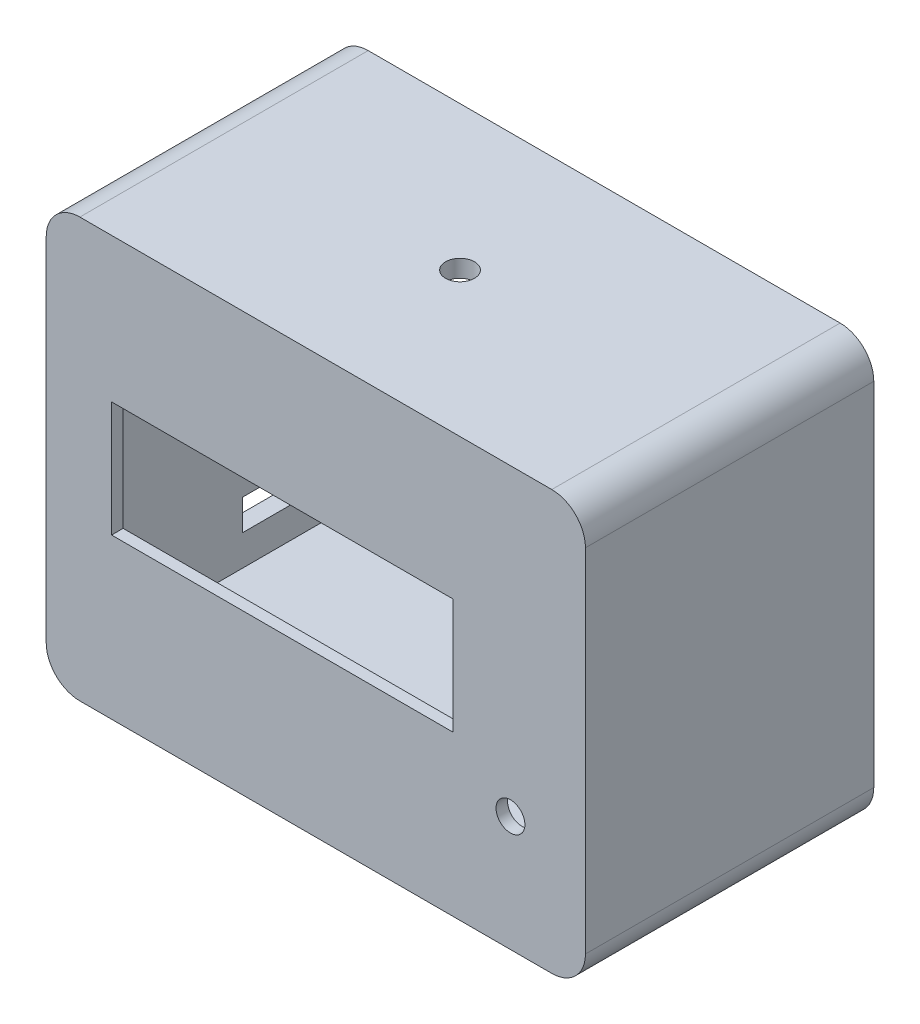
ISO-10303-21;
HEADER;
FILE_DESCRIPTION(('STEP AP214'),'2;1');
FILE_NAME('part.step','',(''),(''),'','','');
FILE_SCHEMA(('AUTOMOTIVE_DESIGN { 1 0 10303 214 1 1 1 1 }'));
ENDSEC;
DATA;
#1=APPLICATION_CONTEXT('core data for automotive mechanical design processes');
#2=APPLICATION_PROTOCOL_DEFINITION('international standard','automotive_design',2000,#1);
#3=PRODUCT_CONTEXT('',#1,'mechanical');
#4=PRODUCT('Part','Part','',(#3));
#5=PRODUCT_RELATED_PRODUCT_CATEGORY('part','',(#4));
#6=PRODUCT_DEFINITION_FORMATION('','',#4);
#7=PRODUCT_DEFINITION_CONTEXT('part definition',#1,'design');
#8=PRODUCT_DEFINITION('design','',#6,#7);
#9=PRODUCT_DEFINITION_SHAPE('','',#8);
#10=(LENGTH_UNIT() NAMED_UNIT(*) SI_UNIT(.MILLI.,.METRE.));
#11=(NAMED_UNIT(*) PLANE_ANGLE_UNIT() SI_UNIT($,.RADIAN.));
#12=(NAMED_UNIT(*) SI_UNIT($,.STERADIAN.) SOLID_ANGLE_UNIT());
#13=UNCERTAINTY_MEASURE_WITH_UNIT(LENGTH_MEASURE(1.E-05),#10,'distance_accuracy_value','');
#14=(GEOMETRIC_REPRESENTATION_CONTEXT(3) GLOBAL_UNCERTAINTY_ASSIGNED_CONTEXT((#13)) GLOBAL_UNIT_ASSIGNED_CONTEXT((#10,
#11,#12)) REPRESENTATION_CONTEXT('',''));
#15=CARTESIAN_POINT('',(0.,0.,0.));
#16=DIRECTION('',(0.,0.,1.));
#17=DIRECTION('',(1.,0.,0.));
#18=AXIS2_PLACEMENT_3D('',#15,#16,#17);
#19=CARTESIAN_POINT('',(-39.2514345621429,20.3831126040352,60.));
#20=DIRECTION('',(1.,0.,0.));
#21=DIRECTION('',(0.,0.,-1.));
#22=AXIS2_PLACEMENT_3D('',#19,#20,#21);
#23=PLANE('',#22);
#24=DIRECTION('',(0.,0.,-1.));
#25=VECTOR('',#24,1.);
#26=CARTESIAN_POINT('',(-39.2514345621429,-3.61688739596483,60.));
#27=LINE('',#26,#25);
#28=CARTESIAN_POINT('',(-39.2514345621429,-3.61688739596483,60.));
#29=VERTEX_POINT('',#28);
#30=CARTESIAN_POINT('',(-39.2514345621429,-3.61688739596483,57.6));
#31=VERTEX_POINT('',#30);
#32=EDGE_CURVE('E269',#29,#31,#27,.T.);
#33=ORIENTED_EDGE('',*,*,#32,.T.);
#34=DIRECTION('',(0.,1.,0.));
#35=VECTOR('',#34,1.);
#36=CARTESIAN_POINT('',(-39.2514345621429,20.3831126040352,57.6));
#37=LINE('',#36,#35);
#38=CARTESIAN_POINT('',(-39.2514345621429,20.3831126040352,57.6));
#39=VERTEX_POINT('',#38);
#40=EDGE_CURVE('E245',#31,#39,#37,.T.);
#41=ORIENTED_EDGE('',*,*,#40,.T.);
#42=DIRECTION('',(0.,0.,-1.));
#43=VECTOR('',#42,1.);
#44=CARTESIAN_POINT('',(-39.2514345621429,20.3831126040352,60.));
#45=LINE('',#44,#43);
#46=CARTESIAN_POINT('',(-39.2514345621429,20.3831126040352,60.));
#47=VERTEX_POINT('',#46);
#48=EDGE_CURVE('E260',#47,#39,#45,.T.);
#49=ORIENTED_EDGE('',*,*,#48,.F.);
#50=DIRECTION('',(0.,-1.,0.));
#51=VECTOR('',#50,1.);
#52=CARTESIAN_POINT('',(-39.2514345621429,20.3831126040352,60.));
#53=LINE('',#52,#51);
#54=EDGE_CURVE('E251',#47,#29,#53,.T.);
#55=ORIENTED_EDGE('',*,*,#54,.T.);
#56=EDGE_LOOP('',(#33,#41,#49,#55));
#57=FACE_BOUND('',#56,.T.);
#58=ADVANCED_FACE('F33',(#57),#23,.T.);
#59=CARTESIAN_POINT('',(-39.2514345621429,-3.61688739596483,60.));
#60=DIRECTION('',(0.,1.,0.));
#61=DIRECTION('',(0.,0.,1.));
#62=AXIS2_PLACEMENT_3D('',#59,#60,#61);
#63=PLANE('',#62);
#64=DIRECTION('',(0.,0.,-1.));
#65=VECTOR('',#64,1.);
#66=CARTESIAN_POINT('',(31.748565437857,-3.61688739596483,60.));
#67=LINE('',#66,#65);
#68=CARTESIAN_POINT('',(31.748565437857,-3.61688739596483,60.));
#69=VERTEX_POINT('',#68);
#70=CARTESIAN_POINT('',(31.748565437857,-3.61688739596483,57.6));
#71=VERTEX_POINT('',#70);
#72=EDGE_CURVE('E266',#69,#71,#67,.T.);
#73=ORIENTED_EDGE('',*,*,#72,.T.);
#74=DIRECTION('',(-1.,0.,0.));
#75=VECTOR('',#74,1.);
#76=CARTESIAN_POINT('',(-39.2514345621429,-3.61688739596483,57.6));
#77=LINE('',#76,#75);
#78=EDGE_CURVE('E242',#71,#31,#77,.T.);
#79=ORIENTED_EDGE('',*,*,#78,.T.);
#80=ORIENTED_EDGE('',*,*,#32,.F.);
#81=DIRECTION('',(1.,0.,0.));
#82=VECTOR('',#81,1.);
#83=CARTESIAN_POINT('',(-39.2514345621429,-3.61688739596483,60.));
#84=LINE('',#83,#82);
#85=EDGE_CURVE('E253',#29,#69,#84,.T.);
#86=ORIENTED_EDGE('',*,*,#85,.T.);
#87=EDGE_LOOP('',(#73,#79,#80,#86));
#88=FACE_BOUND('',#87,.T.);
#89=ADVANCED_FACE('F379',(#88),#63,.T.);
#90=CARTESIAN_POINT('',(31.748565437857,20.3831126040352,60.));
#91=DIRECTION('',(-1.,0.,0.));
#92=DIRECTION('',(0.,-1.,0.));
#93=AXIS2_PLACEMENT_3D('',#90,#91,#92);
#94=PLANE('',#93);
#95=DIRECTION('',(0.,0.,-1.));
#96=VECTOR('',#95,1.);
#97=CARTESIAN_POINT('',(31.748565437857,20.3831126040352,60.));
#98=LINE('',#97,#96);
#99=CARTESIAN_POINT('',(31.748565437857,20.3831126040352,60.));
#100=VERTEX_POINT('',#99);
#101=CARTESIAN_POINT('',(31.748565437857,20.3831126040352,57.6));
#102=VERTEX_POINT('',#101);
#103=EDGE_CURVE('E263',#100,#102,#98,.T.);
#104=ORIENTED_EDGE('',*,*,#103,.T.);
#105=DIRECTION('',(0.,-1.,0.));
#106=VECTOR('',#105,1.);
#107=CARTESIAN_POINT('',(31.748565437857,20.3831126040352,57.6));
#108=LINE('',#107,#106);
#109=EDGE_CURVE('E239',#102,#71,#108,.T.);
#110=ORIENTED_EDGE('',*,*,#109,.T.);
#111=ORIENTED_EDGE('',*,*,#72,.F.);
#112=DIRECTION('',(0.,1.,0.));
#113=VECTOR('',#112,1.);
#114=CARTESIAN_POINT('',(31.748565437857,20.3831126040352,60.));
#115=LINE('',#114,#113);
#116=EDGE_CURVE('E255',#69,#100,#115,.T.);
#117=ORIENTED_EDGE('',*,*,#116,.T.);
#118=EDGE_LOOP('',(#104,#110,#111,#117));
#119=FACE_BOUND('',#118,.T.);
#120=ADVANCED_FACE('F385',(#119),#94,.T.);
#121=CARTESIAN_POINT('',(-39.2514345621429,20.3831126040352,60.));
#122=DIRECTION('',(0.,-1.,0.));
#123=DIRECTION('',(0.,0.,-1.));
#124=AXIS2_PLACEMENT_3D('',#121,#122,#123);
#125=PLANE('',#124);
#126=ORIENTED_EDGE('',*,*,#48,.T.);
#127=DIRECTION('',(1.,0.,0.));
#128=VECTOR('',#127,1.);
#129=CARTESIAN_POINT('',(-39.2514345621429,20.3831126040352,57.6));
#130=LINE('',#129,#128);
#131=EDGE_CURVE('E236',#39,#102,#130,.T.);
#132=ORIENTED_EDGE('',*,*,#131,.T.);
#133=ORIENTED_EDGE('',*,*,#103,.F.);
#134=DIRECTION('',(-1.,0.,0.));
#135=VECTOR('',#134,1.);
#136=CARTESIAN_POINT('',(-39.2514345621429,20.3831126040352,60.));
#137=LINE('',#136,#135);
#138=EDGE_CURVE('E258',#100,#47,#137,.T.);
#139=ORIENTED_EDGE('',*,*,#138,.T.);
#140=EDGE_LOOP('',(#126,#132,#133,#139));
#141=FACE_BOUND('',#140,.T.);
#142=ADVANCED_FACE('F517',(#141),#125,.T.);
#143=CARTESIAN_POINT('',(43.7485654378571,-12.8168873959648,60.));
#144=DIRECTION('',(0.,0.,-1.));
#145=DIRECTION('',(-1.,0.,0.));
#146=AXIS2_PLACEMENT_3D('',#143,#144,#145);
#147=CYLINDRICAL_SURFACE('',#146,3.);
#148=CARTESIAN_POINT('',(43.7485654378571,-12.8168873959648,60.));
#149=DIRECTION('',(0.,0.,1.));
#150=DIRECTION('',(1.,0.,0.));
#151=AXIS2_PLACEMENT_3D('',#148,#149,#150);
#152=CIRCLE('',#151,3.);
#153=CARTESIAN_POINT('',(46.7485654378571,-12.8168873959648,60.));
#154=VERTEX_POINT('',#153);
#155=EDGE_CURVE('E248',#154,#154,#152,.T.);
#156=ORIENTED_EDGE('',*,*,#155,.T.);
#157=EDGE_LOOP('',(#156));
#158=FACE_BOUND('',#157,.T.);
#159=CARTESIAN_POINT('',(43.7485654378571,-12.8168873959648,57.6));
#160=DIRECTION('',(0.,0.,-1.));
#161=DIRECTION('',(-1.,0.,0.));
#162=AXIS2_PLACEMENT_3D('',#159,#160,#161);
#163=CIRCLE('',#162,3.);
#164=CARTESIAN_POINT('',(40.7485654378571,-12.8168873959648,57.6));
#165=VERTEX_POINT('',#164);
#166=EDGE_CURVE('E229',#165,#165,#163,.T.);
#167=ORIENTED_EDGE('',*,*,#166,.T.);
#168=EDGE_LOOP('',(#167));
#169=FACE_BOUND('',#168,.T.);
#170=ADVANCED_FACE('F392',(#158,#169),#147,.F.);
#171=CARTESIAN_POINT('',(0.,0.,60.));
#172=DIRECTION('',(0.,0.,1.));
#173=DIRECTION('',(1.,0.,0.));
#174=AXIS2_PLACEMENT_3D('',#171,#172,#173);
#175=PLANE('',#174);
#176=ORIENTED_EDGE('',*,*,#85,.F.);
#177=ORIENTED_EDGE('',*,*,#54,.F.);
#178=ORIENTED_EDGE('',*,*,#138,.F.);
#179=ORIENTED_EDGE('',*,*,#116,.F.);
#180=EDGE_LOOP('',(#176,#177,#178,#179));
#181=FACE_BOUND('',#180,.T.);
#182=DIRECTION('',(0.,-1.,0.));
#183=VECTOR('',#182,1.);
#184=CARTESIAN_POINT('',(-52.8514345621429,50.3831126040352,60.));
#185=LINE('',#184,#183);
#186=CARTESIAN_POINT('',(-52.8514345621429,43.3831126040352,60.));
#187=VERTEX_POINT('',#186);
#188=CARTESIAN_POINT('',(-52.8514345621429,-29.8168873959648,60.));
#189=VERTEX_POINT('',#188);
#190=EDGE_CURVE('E273',#187,#189,#185,.T.);
#191=ORIENTED_EDGE('',*,*,#190,.T.);
#192=CARTESIAN_POINT('',(-45.8514345621429,-29.8168873959648,60.));
#193=DIRECTION('',(0.,0.,1.));
#194=DIRECTION('',(1.,0.,0.));
#195=AXIS2_PLACEMENT_3D('',#192,#193,#194);
#196=CIRCLE('',#195,7.);
#197=CARTESIAN_POINT('',(-45.8514345621429,-36.8168873959648,60.));
#198=VERTEX_POINT('',#197);
#199=EDGE_CURVE('E322',#189,#198,#196,.T.);
#200=ORIENTED_EDGE('',*,*,#199,.T.);
#201=DIRECTION('',(1.,0.,0.));
#202=VECTOR('',#201,1.);
#203=CARTESIAN_POINT('',(-52.8514345621429,-36.8168873959648,60.));
#204=LINE('',#203,#202);
#205=CARTESIAN_POINT('',(52.3485654378571,-36.8168873959648,60.));
#206=VERTEX_POINT('',#205);
#207=EDGE_CURVE('E276',#198,#206,#204,.T.);
#208=ORIENTED_EDGE('',*,*,#207,.T.);
#209=CARTESIAN_POINT('',(52.3485654378571,-29.8168873959648,60.));
#210=DIRECTION('',(0.,0.,1.));
#211=DIRECTION('',(1.,0.,0.));
#212=AXIS2_PLACEMENT_3D('',#209,#210,#211);
#213=CIRCLE('',#212,7.);
#214=CARTESIAN_POINT('',(59.3485654378571,-29.8168873959648,60.));
#215=VERTEX_POINT('',#214);
#216=EDGE_CURVE('E320',#206,#215,#213,.T.);
#217=ORIENTED_EDGE('',*,*,#216,.T.);
#218=DIRECTION('',(0.,1.,0.));
#219=VECTOR('',#218,1.);
#220=CARTESIAN_POINT('',(59.3485654378571,50.3831126040352,60.));
#221=LINE('',#220,#219);
#222=CARTESIAN_POINT('',(59.3485654378571,43.3831126040352,60.));
#223=VERTEX_POINT('',#222);
#224=EDGE_CURVE('E280',#215,#223,#221,.T.);
#225=ORIENTED_EDGE('',*,*,#224,.T.);
#226=CARTESIAN_POINT('',(52.3485654378571,43.3831126040352,60.));
#227=DIRECTION('',(0.,0.,1.));
#228=DIRECTION('',(1.,0.,0.));
#229=AXIS2_PLACEMENT_3D('',#226,#227,#228);
#230=CIRCLE('',#229,7.);
#231=CARTESIAN_POINT('',(52.3485654378571,50.3831126040352,60.));
#232=VERTEX_POINT('',#231);
#233=EDGE_CURVE('E316',#223,#232,#230,.T.);
#234=ORIENTED_EDGE('',*,*,#233,.T.);
#235=DIRECTION('',(-1.,0.,0.));
#236=VECTOR('',#235,1.);
#237=CARTESIAN_POINT('',(-52.8514345621429,50.3831126040352,60.));
#238=LINE('',#237,#236);
#239=CARTESIAN_POINT('',(-45.8514345621429,50.3831126040352,60.));
#240=VERTEX_POINT('',#239);
#241=EDGE_CURVE('E283',#232,#240,#238,.T.);
#242=ORIENTED_EDGE('',*,*,#241,.T.);
#243=CARTESIAN_POINT('',(-45.8514345621429,43.3831126040352,60.));
#244=DIRECTION('',(0.,0.,1.));
#245=DIRECTION('',(1.,0.,0.));
#246=AXIS2_PLACEMENT_3D('',#243,#244,#245);
#247=CIRCLE('',#246,7.);
#248=EDGE_CURVE('E318',#240,#187,#247,.T.);
#249=ORIENTED_EDGE('',*,*,#248,.T.);
#250=EDGE_LOOP('',(#191,#200,#208,#217,#225,#234,#242,#249));
#251=FACE_BOUND('',#250,.T.);
#252=ORIENTED_EDGE('',*,*,#155,.F.);
#253=EDGE_LOOP('',(#252));
#254=FACE_BOUND('',#253,.T.);
#255=ADVANCED_FACE('F352',(#181,#251,#254),#175,.T.);
#256=CARTESIAN_POINT('',(0.,0.,0.));
#257=DIRECTION('',(0.,0.,1.));
#258=DIRECTION('',(1.,0.,0.));
#259=AXIS2_PLACEMENT_3D('',#256,#257,#258);
#260=PLANE('',#259);
#261=DIRECTION('',(-1.,0.,0.));
#262=VECTOR('',#261,1.);
#263=CARTESIAN_POINT('',(55.7485654378571,-33.2168873959648,0.));
#264=LINE('',#263,#262);
#265=CARTESIAN_POINT('',(55.7485654378571,-33.2168873959648,0.));
#266=VERTEX_POINT('',#265);
#267=CARTESIAN_POINT('',(-49.251434562143,-33.2168873959648,0.));
#268=VERTEX_POINT('',#267);
#269=EDGE_CURVE('E219',#266,#268,#264,.T.);
#270=ORIENTED_EDGE('',*,*,#269,.F.);
#271=DIRECTION('',(0.,-1.,0.));
#272=VECTOR('',#271,1.);
#273=CARTESIAN_POINT('',(55.7485654378571,46.7831126040352,0.));
#274=LINE('',#273,#272);
#275=CARTESIAN_POINT('',(55.7485654378571,46.7831126040352,0.));
#276=VERTEX_POINT('',#275);
#277=EDGE_CURVE('E203',#276,#266,#274,.T.);
#278=ORIENTED_EDGE('',*,*,#277,.F.);
#279=DIRECTION('',(1.,0.,0.));
#280=VECTOR('',#279,1.);
#281=CARTESIAN_POINT('',(55.7485654378571,46.7831126040352,0.));
#282=LINE('',#281,#280);
#283=CARTESIAN_POINT('',(-49.251434562143,46.7831126040352,0.));
#284=VERTEX_POINT('',#283);
#285=EDGE_CURVE('E208',#284,#276,#282,.T.);
#286=ORIENTED_EDGE('',*,*,#285,.F.);
#287=DIRECTION('',(0.,1.,0.));
#288=VECTOR('',#287,1.);
#289=CARTESIAN_POINT('',(-49.251434562143,46.7831126040352,0.));
#290=LINE('',#289,#288);
#291=EDGE_CURVE('E222',#268,#284,#290,.T.);
#292=ORIENTED_EDGE('',*,*,#291,.F.);
#293=EDGE_LOOP('',(#270,#278,#286,#292));
#294=FACE_BOUND('',#293,.T.);
#295=DIRECTION('',(1.,0.,0.));
#296=VECTOR('',#295,1.);
#297=CARTESIAN_POINT('',(-52.8514345621429,-36.8168873959648,0.));
#298=LINE('',#297,#296);
#299=CARTESIAN_POINT('',(-45.8514345621429,-36.8168873959648,0.));
#300=VERTEX_POINT('',#299);
#301=CARTESIAN_POINT('',(52.3485654378571,-36.8168873959648,0.));
#302=VERTEX_POINT('',#301);
#303=EDGE_CURVE('E289',#300,#302,#298,.T.);
#304=ORIENTED_EDGE('',*,*,#303,.F.);
#305=CARTESIAN_POINT('',(-45.8514345621429,-29.8168873959648,0.));
#306=DIRECTION('',(0.,0.,1.));
#307=DIRECTION('',(1.,0.,0.));
#308=AXIS2_PLACEMENT_3D('',#305,#306,#307);
#309=CIRCLE('',#308,7.);
#310=CARTESIAN_POINT('',(-52.8514345621429,-29.8168873959648,0.));
#311=VERTEX_POINT('',#310);
#312=EDGE_CURVE('E309',#300,#311,#309,.F.);
#313=ORIENTED_EDGE('',*,*,#312,.T.);
#314=DIRECTION('',(0.,-1.,0.));
#315=VECTOR('',#314,1.);
#316=CARTESIAN_POINT('',(-52.8514345621429,50.3831126040352,0.));
#317=LINE('',#316,#315);
#318=CARTESIAN_POINT('',(-52.8514345621429,43.3831126040352,0.));
#319=VERTEX_POINT('',#318);
#320=EDGE_CURVE('E272',#319,#311,#317,.T.);
#321=ORIENTED_EDGE('',*,*,#320,.F.);
#322=CARTESIAN_POINT('',(-45.8514345621429,43.3831126040352,0.));
#323=DIRECTION('',(0.,0.,1.));
#324=DIRECTION('',(1.,0.,0.));
#325=AXIS2_PLACEMENT_3D('',#322,#323,#324);
#326=CIRCLE('',#325,7.);
#327=CARTESIAN_POINT('',(-45.8514345621429,50.3831126040352,0.));
#328=VERTEX_POINT('',#327);
#329=EDGE_CURVE('E305',#319,#328,#326,.F.);
#330=ORIENTED_EDGE('',*,*,#329,.T.);
#331=DIRECTION('',(-1.,0.,0.));
#332=VECTOR('',#331,1.);
#333=CARTESIAN_POINT('',(-52.8514345621429,50.3831126040352,0.));
#334=LINE('',#333,#332);
#335=CARTESIAN_POINT('',(52.3485654378571,50.3831126040352,0.));
#336=VERTEX_POINT('',#335);
#337=EDGE_CURVE('E277',#336,#328,#334,.T.);
#338=ORIENTED_EDGE('',*,*,#337,.F.);
#339=CARTESIAN_POINT('',(52.3485654378571,43.3831126040352,0.));
#340=DIRECTION('',(0.,0.,1.));
#341=DIRECTION('',(1.,0.,0.));
#342=AXIS2_PLACEMENT_3D('',#339,#340,#341);
#343=CIRCLE('',#342,7.);
#344=CARTESIAN_POINT('',(59.3485654378571,43.3831126040352,0.));
#345=VERTEX_POINT('',#344);
#346=EDGE_CURVE('E303',#336,#345,#343,.F.);
#347=ORIENTED_EDGE('',*,*,#346,.T.);
#348=DIRECTION('',(0.,1.,0.));
#349=VECTOR('',#348,1.);
#350=CARTESIAN_POINT('',(59.3485654378571,50.3831126040352,0.));
#351=LINE('',#350,#349);
#352=CARTESIAN_POINT('',(59.3485654378571,-29.8168873959648,0.));
#353=VERTEX_POINT('',#352);
#354=EDGE_CURVE('E292',#353,#345,#351,.T.);
#355=ORIENTED_EDGE('',*,*,#354,.F.);
#356=CARTESIAN_POINT('',(52.3485654378571,-29.8168873959648,0.));
#357=DIRECTION('',(0.,0.,1.));
#358=DIRECTION('',(1.,0.,0.));
#359=AXIS2_PLACEMENT_3D('',#356,#357,#358);
#360=CIRCLE('',#359,7.);
#361=EDGE_CURVE('E307',#353,#302,#360,.F.);
#362=ORIENTED_EDGE('',*,*,#361,.T.);
#363=EDGE_LOOP('',(#304,#313,#321,#330,#338,#347,#355,#362));
#364=FACE_BOUND('',#363,.T.);
#365=ADVANCED_FACE('F339',(#294,#364),#260,.F.);
#366=CARTESIAN_POINT('',(-52.8514345621429,50.3831126040352,60.));
#367=DIRECTION('',(1.,0.,0.));
#368=DIRECTION('',(0.,1.,0.));
#369=AXIS2_PLACEMENT_3D('',#366,#367,#368);
#370=PLANE('',#369);
#371=DIRECTION('',(0.,1.,0.));
#372=VECTOR('',#371,1.);
#373=CARTESIAN_POINT('',(-52.8514345621429,-20.4241998512089,22.8));
#374=LINE('',#373,#372);
#375=CARTESIAN_POINT('',(-52.8514345621429,-26.8241998512089,22.8));
#376=VERTEX_POINT('',#375);
#377=CARTESIAN_POINT('',(-52.8514345621429,-20.4241998512089,22.8));
#378=VERTEX_POINT('',#377);
#379=EDGE_CURVE('E619',#376,#378,#374,.T.);
#380=ORIENTED_EDGE('',*,*,#379,.F.);
#381=DIRECTION('',(0.,0.,1.));
#382=VECTOR('',#381,1.);
#383=CARTESIAN_POINT('',(-52.8514345621429,-26.8241998512089,3.4));
#384=LINE('',#383,#382);
#385=CARTESIAN_POINT('',(-52.8514345621429,-26.8241998512089,3.4));
#386=VERTEX_POINT('',#385);
#387=EDGE_CURVE('E621',#386,#376,#384,.T.);
#388=ORIENTED_EDGE('',*,*,#387,.F.);
#389=DIRECTION('',(0.,-1.,0.));
#390=VECTOR('',#389,1.);
#391=CARTESIAN_POINT('',(-52.8514345621429,-20.4241998512089,3.4));
#392=LINE('',#391,#390);
#393=CARTESIAN_POINT('',(-52.8514345621429,-20.4241998512089,3.4));
#394=VERTEX_POINT('',#393);
#395=EDGE_CURVE('E189',#394,#386,#392,.T.);
#396=ORIENTED_EDGE('',*,*,#395,.F.);
#397=DIRECTION('',(0.,0.,-1.));
#398=VECTOR('',#397,1.);
#399=CARTESIAN_POINT('',(-52.8514345621429,-20.4241998512089,3.4));
#400=LINE('',#399,#398);
#401=EDGE_CURVE('E48',#378,#394,#400,.T.);
#402=ORIENTED_EDGE('',*,*,#401,.F.);
#403=EDGE_LOOP('',(#380,#388,#396,#402));
#404=FACE_BOUND('',#403,.T.);
#405=ORIENTED_EDGE('',*,*,#320,.T.);
#406=DIRECTION('',(0.,0.,-1.));
#407=VECTOR('',#406,1.);
#408=CARTESIAN_POINT('',(-52.8514345621429,-29.8168873959648,60.));
#409=LINE('',#408,#407);
#410=EDGE_CURVE('E314',#311,#189,#409,.F.);
#411=ORIENTED_EDGE('',*,*,#410,.T.);
#412=ORIENTED_EDGE('',*,*,#190,.F.);
#413=DIRECTION('',(0.,0.,-1.));
#414=VECTOR('',#413,1.);
#415=CARTESIAN_POINT('',(-52.8514345621429,43.3831126040352,60.));
#416=LINE('',#415,#414);
#417=EDGE_CURVE('E311',#187,#319,#416,.T.);
#418=ORIENTED_EDGE('',*,*,#417,.T.);
#419=EDGE_LOOP('',(#405,#411,#412,#418));
#420=FACE_BOUND('',#419,.T.);
#421=ADVANCED_FACE('F348',(#404,#420),#370,.F.);
#422=CARTESIAN_POINT('',(-52.8514345621429,-36.8168873959648,60.));
#423=DIRECTION('',(0.,1.,0.));
#424=DIRECTION('',(0.,0.,1.));
#425=AXIS2_PLACEMENT_3D('',#422,#423,#424);
#426=PLANE('',#425);
#427=ORIENTED_EDGE('',*,*,#207,.F.);
#428=DIRECTION('',(0.,0.,-1.));
#429=VECTOR('',#428,1.);
#430=CARTESIAN_POINT('',(-45.8514345621429,-36.8168873959648,60.));
#431=LINE('',#430,#429);
#432=EDGE_CURVE('E300',#198,#300,#431,.T.);
#433=ORIENTED_EDGE('',*,*,#432,.T.);
#434=ORIENTED_EDGE('',*,*,#303,.T.);
#435=DIRECTION('',(0.,0.,-1.));
#436=VECTOR('',#435,1.);
#437=CARTESIAN_POINT('',(52.3485654378571,-36.8168873959648,60.));
#438=LINE('',#437,#436);
#439=EDGE_CURVE('E286',#302,#206,#438,.F.);
#440=ORIENTED_EDGE('',*,*,#439,.T.);
#441=EDGE_LOOP('',(#427,#433,#434,#440));
#442=FACE_BOUND('',#441,.T.);
#443=ADVANCED_FACE('F359',(#442),#426,.F.);
#444=CARTESIAN_POINT('',(59.3485654378571,50.3831126040352,60.));
#445=DIRECTION('',(-1.,0.,0.));
#446=DIRECTION('',(0.,-1.,0.));
#447=AXIS2_PLACEMENT_3D('',#444,#445,#446);
#448=PLANE('',#447);
#449=ORIENTED_EDGE('',*,*,#224,.F.);
#450=DIRECTION('',(0.,0.,-1.));
#451=VECTOR('',#450,1.);
#452=CARTESIAN_POINT('',(59.3485654378571,-29.8168873959648,60.));
#453=LINE('',#452,#451);
#454=EDGE_CURVE('E326',#215,#353,#453,.T.);
#455=ORIENTED_EDGE('',*,*,#454,.T.);
#456=ORIENTED_EDGE('',*,*,#354,.T.);
#457=DIRECTION('',(0.,0.,-1.));
#458=VECTOR('',#457,1.);
#459=CARTESIAN_POINT('',(59.3485654378571,43.3831126040352,60.));
#460=LINE('',#459,#458);
#461=EDGE_CURVE('E324',#345,#223,#460,.F.);
#462=ORIENTED_EDGE('',*,*,#461,.T.);
#463=EDGE_LOOP('',(#449,#455,#456,#462));
#464=FACE_BOUND('',#463,.T.);
#465=ADVANCED_FACE('F367',(#464),#448,.F.);
#466=CARTESIAN_POINT('',(-52.8514345621429,50.3831126040352,60.));
#467=DIRECTION('',(0.,-1.,0.));
#468=DIRECTION('',(0.,0.,-1.));
#469=AXIS2_PLACEMENT_3D('',#466,#467,#468);
#470=PLANE('',#469);
#471=CARTESIAN_POINT('',(3.24856543785706,50.3831126040352,30.));
#472=DIRECTION('',(0.,1.,0.));
#473=DIRECTION('',(0.,0.,1.));
#474=AXIS2_PLACEMENT_3D('',#471,#472,#473);
#475=CIRCLE('',#474,3.);
#476=CARTESIAN_POINT('',(3.24856543785706,50.3831126040352,33.));
#477=VERTEX_POINT('',#476);
#478=EDGE_CURVE('E197',#477,#477,#475,.T.);
#479=ORIENTED_EDGE('',*,*,#478,.F.);
#480=EDGE_LOOP('',(#479));
#481=FACE_BOUND('',#480,.T.);
#482=ORIENTED_EDGE('',*,*,#337,.T.);
#483=DIRECTION('',(0.,0.,-1.));
#484=VECTOR('',#483,1.);
#485=CARTESIAN_POINT('',(-45.8514345621429,50.3831126040352,60.));
#486=LINE('',#485,#484);
#487=EDGE_CURVE('E11',#328,#240,#486,.F.);
#488=ORIENTED_EDGE('',*,*,#487,.T.);
#489=ORIENTED_EDGE('',*,*,#241,.F.);
#490=DIRECTION('',(0.,0.,-1.));
#491=VECTOR('',#490,1.);
#492=CARTESIAN_POINT('',(52.3485654378571,50.3831126040352,60.));
#493=LINE('',#492,#491);
#494=EDGE_CURVE('E41',#232,#336,#493,.T.);
#495=ORIENTED_EDGE('',*,*,#494,.T.);
#496=EDGE_LOOP('',(#482,#488,#489,#495));
#497=FACE_BOUND('',#496,.T.);
#498=ADVANCED_FACE('F333',(#481,#497),#470,.F.);
#499=CARTESIAN_POINT('',(55.7485654378571,46.7831126040352,57.6));
#500=DIRECTION('',(1.,0.,0.));
#501=DIRECTION('',(0.,1.,0.));
#502=AXIS2_PLACEMENT_3D('',#499,#500,#501);
#503=PLANE('',#502);
#504=ORIENTED_EDGE('',*,*,#277,.T.);
#505=DIRECTION('',(0.,0.,-1.));
#506=VECTOR('',#505,1.);
#507=CARTESIAN_POINT('',(55.7485654378571,-33.2168873959648,57.6));
#508=LINE('',#507,#506);
#509=CARTESIAN_POINT('',(55.7485654378571,-33.2168873959648,57.6));
#510=VERTEX_POINT('',#509);
#511=EDGE_CURVE('E217',#510,#266,#508,.T.);
#512=ORIENTED_EDGE('',*,*,#511,.F.);
#513=DIRECTION('',(0.,-1.,0.));
#514=VECTOR('',#513,1.);
#515=CARTESIAN_POINT('',(55.7485654378571,46.7831126040352,57.6));
#516=LINE('',#515,#514);
#517=CARTESIAN_POINT('',(55.7485654378571,46.7831126040352,57.6));
#518=VERTEX_POINT('',#517);
#519=EDGE_CURVE('E204',#518,#510,#516,.T.);
#520=ORIENTED_EDGE('',*,*,#519,.F.);
#521=DIRECTION('',(0.,0.,-1.));
#522=VECTOR('',#521,1.);
#523=CARTESIAN_POINT('',(55.7485654378571,46.7831126040352,57.6));
#524=LINE('',#523,#522);
#525=EDGE_CURVE('E227',#518,#276,#524,.T.);
#526=ORIENTED_EDGE('',*,*,#525,.T.);
#527=EDGE_LOOP('',(#504,#512,#520,#526));
#528=FACE_BOUND('',#527,.T.);
#529=ADVANCED_FACE('F399',(#528),#503,.F.);
#530=CARTESIAN_POINT('',(55.7485654378571,46.7831126040352,57.6));
#531=DIRECTION('',(0.,1.,0.));
#532=DIRECTION('',(0.,0.,1.));
#533=AXIS2_PLACEMENT_3D('',#530,#531,#532);
#534=PLANE('',#533);
#535=CARTESIAN_POINT('',(3.24856543785706,46.7831126040352,30.));
#536=DIRECTION('',(0.,1.,0.));
#537=DIRECTION('',(0.,0.,1.));
#538=AXIS2_PLACEMENT_3D('',#535,#536,#537);
#539=CIRCLE('',#538,3.);
#540=CARTESIAN_POINT('',(3.24856543785706,46.7831126040352,33.));
#541=VERTEX_POINT('',#540);
#542=EDGE_CURVE('E200',#541,#541,#539,.F.);
#543=ORIENTED_EDGE('',*,*,#542,.F.);
#544=EDGE_LOOP('',(#543));
#545=FACE_BOUND('',#544,.T.);
#546=ORIENTED_EDGE('',*,*,#285,.T.);
#547=ORIENTED_EDGE('',*,*,#525,.F.);
#548=DIRECTION('',(1.,0.,0.));
#549=VECTOR('',#548,1.);
#550=CARTESIAN_POINT('',(55.7485654378571,46.7831126040352,57.6));
#551=LINE('',#550,#549);
#552=CARTESIAN_POINT('',(-49.251434562143,46.7831126040352,57.6));
#553=VERTEX_POINT('',#552);
#554=EDGE_CURVE('E214',#553,#518,#551,.T.);
#555=ORIENTED_EDGE('',*,*,#554,.F.);
#556=DIRECTION('',(0.,0.,-1.));
#557=VECTOR('',#556,1.);
#558=CARTESIAN_POINT('',(-49.251434562143,46.7831126040352,57.6));
#559=LINE('',#558,#557);
#560=EDGE_CURVE('E230',#553,#284,#559,.T.);
#561=ORIENTED_EDGE('',*,*,#560,.T.);
#562=EDGE_LOOP('',(#546,#547,#555,#561));
#563=FACE_BOUND('',#562,.T.);
#564=ADVANCED_FACE('F440',(#545,#563),#534,.F.);
#565=CARTESIAN_POINT('',(-49.251434562143,46.7831126040352,57.6));
#566=DIRECTION('',(-1.,0.,0.));
#567=DIRECTION('',(0.,0.,1.));
#568=AXIS2_PLACEMENT_3D('',#565,#566,#567);
#569=PLANE('',#568);
#570=DIRECTION('',(0.,1.,0.));
#571=VECTOR('',#570,1.);
#572=CARTESIAN_POINT('',(-49.251434562143,-20.4241998512089,3.4));
#573=LINE('',#572,#571);
#574=CARTESIAN_POINT('',(-49.251434562143,-26.8241998512089,3.4));
#575=VERTEX_POINT('',#574);
#576=CARTESIAN_POINT('',(-49.2514345621429,-20.4241998512089,3.4));
#577=VERTEX_POINT('',#576);
#578=EDGE_CURVE('E180',#575,#577,#573,.T.);
#579=ORIENTED_EDGE('',*,*,#578,.F.);
#580=DIRECTION('',(0.,0.,-1.));
#581=VECTOR('',#580,1.);
#582=CARTESIAN_POINT('',(-49.251434562143,-26.8241998512089,3.4));
#583=LINE('',#582,#581);
#584=CARTESIAN_POINT('',(-49.2514345621429,-26.8241998512089,22.8));
#585=VERTEX_POINT('',#584);
#586=EDGE_CURVE('E56',#585,#575,#583,.T.);
#587=ORIENTED_EDGE('',*,*,#586,.F.);
#588=DIRECTION('',(0.,-1.,0.));
#589=VECTOR('',#588,1.);
#590=CARTESIAN_POINT('',(-49.251434562143,-20.4241998512089,22.8));
#591=LINE('',#590,#589);
#592=CARTESIAN_POINT('',(-49.2514345621429,-20.4241998512089,22.8));
#593=VERTEX_POINT('',#592);
#594=EDGE_CURVE('E187',#593,#585,#591,.T.);
#595=ORIENTED_EDGE('',*,*,#594,.F.);
#596=DIRECTION('',(0.,0.,1.));
#597=VECTOR('',#596,1.);
#598=CARTESIAN_POINT('',(-49.251434562143,-20.4241998512089,3.4));
#599=LINE('',#598,#597);
#600=EDGE_CURVE('E171',#577,#593,#599,.T.);
#601=ORIENTED_EDGE('',*,*,#600,.F.);
#602=EDGE_LOOP('',(#579,#587,#595,#601));
#603=FACE_BOUND('',#602,.T.);
#604=ORIENTED_EDGE('',*,*,#291,.T.);
#605=ORIENTED_EDGE('',*,*,#560,.F.);
#606=DIRECTION('',(0.,1.,0.));
#607=VECTOR('',#606,1.);
#608=CARTESIAN_POINT('',(-49.251434562143,46.7831126040352,57.6));
#609=LINE('',#608,#607);
#610=CARTESIAN_POINT('',(-49.251434562143,-33.2168873959648,57.6));
#611=VERTEX_POINT('',#610);
#612=EDGE_CURVE('E211',#611,#553,#609,.T.);
#613=ORIENTED_EDGE('',*,*,#612,.F.);
#614=DIRECTION('',(0.,0.,-1.));
#615=VECTOR('',#614,1.);
#616=CARTESIAN_POINT('',(-49.251434562143,-33.2168873959648,57.6));
#617=LINE('',#616,#615);
#618=EDGE_CURVE('E232',#611,#268,#617,.T.);
#619=ORIENTED_EDGE('',*,*,#618,.T.);
#620=EDGE_LOOP('',(#604,#605,#613,#619));
#621=FACE_BOUND('',#620,.T.);
#622=ADVANCED_FACE('F184',(#603,#621),#569,.F.);
#623=CARTESIAN_POINT('',(55.7485654378571,-33.2168873959648,57.6));
#624=DIRECTION('',(0.,-1.,0.));
#625=DIRECTION('',(0.,0.,-1.));
#626=AXIS2_PLACEMENT_3D('',#623,#624,#625);
#627=PLANE('',#626);
#628=ORIENTED_EDGE('',*,*,#269,.T.);
#629=ORIENTED_EDGE('',*,*,#618,.F.);
#630=DIRECTION('',(-1.,0.,0.));
#631=VECTOR('',#630,1.);
#632=CARTESIAN_POINT('',(55.7485654378571,-33.2168873959648,57.6));
#633=LINE('',#632,#631);
#634=EDGE_CURVE('E207',#510,#611,#633,.T.);
#635=ORIENTED_EDGE('',*,*,#634,.F.);
#636=ORIENTED_EDGE('',*,*,#511,.T.);
#637=EDGE_LOOP('',(#628,#629,#635,#636));
#638=FACE_BOUND('',#637,.T.);
#639=ADVANCED_FACE('F470',(#638),#627,.F.);
#640=CARTESIAN_POINT('',(0.,0.,57.6));
#641=DIRECTION('',(0.,0.,-1.));
#642=DIRECTION('',(-1.,0.,0.));
#643=AXIS2_PLACEMENT_3D('',#640,#641,#642);
#644=PLANE('',#643);
#645=ORIENTED_EDGE('',*,*,#78,.F.);
#646=ORIENTED_EDGE('',*,*,#109,.F.);
#647=ORIENTED_EDGE('',*,*,#131,.F.);
#648=ORIENTED_EDGE('',*,*,#40,.F.);
#649=EDGE_LOOP('',(#645,#646,#647,#648));
#650=FACE_BOUND('',#649,.T.);
#651=ORIENTED_EDGE('',*,*,#166,.F.);
#652=EDGE_LOOP('',(#651));
#653=FACE_BOUND('',#652,.T.);
#654=ORIENTED_EDGE('',*,*,#519,.T.);
#655=ORIENTED_EDGE('',*,*,#634,.T.);
#656=ORIENTED_EDGE('',*,*,#612,.T.);
#657=ORIENTED_EDGE('',*,*,#554,.T.);
#658=EDGE_LOOP('',(#654,#655,#656,#657));
#659=FACE_BOUND('',#658,.T.);
#660=ADVANCED_FACE('F410',(#650,#653,#659),#644,.T.);
#661=CARTESIAN_POINT('',(-45.8514345621429,-29.8168873959648,60.));
#662=DIRECTION('',(0.,0.,-1.));
#663=DIRECTION('',(-1.,0.,0.));
#664=AXIS2_PLACEMENT_3D('',#661,#662,#663);
#665=CYLINDRICAL_SURFACE('',#664,7.);
#666=ORIENTED_EDGE('',*,*,#199,.F.);
#667=ORIENTED_EDGE('',*,*,#410,.F.);
#668=ORIENTED_EDGE('',*,*,#312,.F.);
#669=ORIENTED_EDGE('',*,*,#432,.F.);
#670=EDGE_LOOP('',(#666,#667,#668,#669));
#671=FACE_BOUND('',#670,.T.);
#672=ADVANCED_FACE('F357',(#671),#665,.T.);
#673=CARTESIAN_POINT('',(52.3485654378571,-29.8168873959648,60.));
#674=DIRECTION('',(0.,0.,-1.));
#675=DIRECTION('',(-1.,0.,0.));
#676=AXIS2_PLACEMENT_3D('',#673,#674,#675);
#677=CYLINDRICAL_SURFACE('',#676,7.);
#678=ORIENTED_EDGE('',*,*,#216,.F.);
#679=ORIENTED_EDGE('',*,*,#439,.F.);
#680=ORIENTED_EDGE('',*,*,#361,.F.);
#681=ORIENTED_EDGE('',*,*,#454,.F.);
#682=EDGE_LOOP('',(#678,#679,#680,#681));
#683=FACE_BOUND('',#682,.T.);
#684=ADVANCED_FACE('F364',(#683),#677,.T.);
#685=CARTESIAN_POINT('',(-45.8514345621429,43.3831126040352,60.));
#686=DIRECTION('',(0.,0.,-1.));
#687=DIRECTION('',(-1.,0.,0.));
#688=AXIS2_PLACEMENT_3D('',#685,#686,#687);
#689=CYLINDRICAL_SURFACE('',#688,7.);
#690=ORIENTED_EDGE('',*,*,#248,.F.);
#691=ORIENTED_EDGE('',*,*,#487,.F.);
#692=ORIENTED_EDGE('',*,*,#329,.F.);
#693=ORIENTED_EDGE('',*,*,#417,.F.);
#694=EDGE_LOOP('',(#690,#691,#692,#693));
#695=FACE_BOUND('',#694,.T.);
#696=ADVANCED_FACE('F345',(#695),#689,.T.);
#697=CARTESIAN_POINT('',(52.3485654378571,43.3831126040352,60.));
#698=DIRECTION('',(0.,0.,-1.));
#699=DIRECTION('',(-1.,0.,0.));
#700=AXIS2_PLACEMENT_3D('',#697,#698,#699);
#701=CYLINDRICAL_SURFACE('',#700,7.);
#702=ORIENTED_EDGE('',*,*,#233,.F.);
#703=ORIENTED_EDGE('',*,*,#461,.F.);
#704=ORIENTED_EDGE('',*,*,#346,.F.);
#705=ORIENTED_EDGE('',*,*,#494,.F.);
#706=EDGE_LOOP('',(#702,#703,#704,#705));
#707=FACE_BOUND('',#706,.T.);
#708=ADVANCED_FACE('F35',(#707),#701,.T.);
#709=CARTESIAN_POINT('',(3.24856543785706,-36.8178873959648,30.));
#710=DIRECTION('',(0.,1.,0.));
#711=DIRECTION('',(0.,0.,1.));
#712=AXIS2_PLACEMENT_3D('',#709,#710,#711);
#713=CYLINDRICAL_SURFACE('',#712,3.);
#714=ORIENTED_EDGE('',*,*,#478,.T.);
#715=EDGE_LOOP('',(#714));
#716=FACE_BOUND('',#715,.T.);
#717=ORIENTED_EDGE('',*,*,#542,.T.);
#718=EDGE_LOOP('',(#717));
#719=FACE_BOUND('',#718,.T.);
#720=ADVANCED_FACE('F370',(#716,#719),#713,.F.);
#721=CARTESIAN_POINT('',(59.3495654378571,-26.8241998512089,3.4));
#722=DIRECTION('',(0.,-1.,0.));
#723=DIRECTION('',(1.,0.,0.));
#724=AXIS2_PLACEMENT_3D('',#721,#722,#723);
#725=PLANE('',#724);
#726=ORIENTED_EDGE('',*,*,#586,.T.);
#727=DIRECTION('',(-1.,0.,0.));
#728=VECTOR('',#727,1.);
#729=CARTESIAN_POINT('',(59.3495654378571,-26.8241998512089,3.4));
#730=LINE('',#729,#728);
#731=EDGE_CURVE('E176',#575,#386,#730,.T.);
#732=ORIENTED_EDGE('',*,*,#731,.T.);
#733=ORIENTED_EDGE('',*,*,#387,.T.);
#734=DIRECTION('',(-1.,0.,0.));
#735=VECTOR('',#734,1.);
#736=CARTESIAN_POINT('',(59.3495654378571,-26.8241998512089,22.8));
#737=LINE('',#736,#735);
#738=EDGE_CURVE('E194',#585,#376,#737,.T.);
#739=ORIENTED_EDGE('',*,*,#738,.F.);
#740=EDGE_LOOP('',(#726,#732,#733,#739));
#741=FACE_BOUND('',#740,.T.);
#742=ADVANCED_FACE('F375',(#741),#725,.F.);
#743=CARTESIAN_POINT('',(59.3495654378571,-20.4241998512089,22.8));
#744=DIRECTION('',(0.,0.,1.));
#745=DIRECTION('',(0.,-1.,0.));
#746=AXIS2_PLACEMENT_3D('',#743,#744,#745);
#747=PLANE('',#746);
#748=ORIENTED_EDGE('',*,*,#594,.T.);
#749=ORIENTED_EDGE('',*,*,#738,.T.);
#750=ORIENTED_EDGE('',*,*,#379,.T.);
#751=DIRECTION('',(-1.,0.,0.));
#752=VECTOR('',#751,1.);
#753=CARTESIAN_POINT('',(59.3495654378571,-20.4241998512089,22.8));
#754=LINE('',#753,#752);
#755=EDGE_CURVE('E177',#593,#378,#754,.T.);
#756=ORIENTED_EDGE('',*,*,#755,.F.);
#757=EDGE_LOOP('',(#748,#749,#750,#756));
#758=FACE_BOUND('',#757,.T.);
#759=ADVANCED_FACE('F479',(#758),#747,.F.);
#760=CARTESIAN_POINT('',(59.3495654378571,-20.4241998512089,3.4));
#761=DIRECTION('',(0.,1.,0.));
#762=DIRECTION('',(-1.,0.,0.));
#763=AXIS2_PLACEMENT_3D('',#760,#761,#762);
#764=PLANE('',#763);
#765=ORIENTED_EDGE('',*,*,#600,.T.);
#766=ORIENTED_EDGE('',*,*,#755,.T.);
#767=ORIENTED_EDGE('',*,*,#401,.T.);
#768=DIRECTION('',(-1.,0.,0.));
#769=VECTOR('',#768,1.);
#770=CARTESIAN_POINT('',(59.3495654378571,-20.4241998512089,3.4));
#771=LINE('',#770,#769);
#772=EDGE_CURVE('E167',#577,#394,#771,.T.);
#773=ORIENTED_EDGE('',*,*,#772,.F.);
#774=EDGE_LOOP('',(#765,#766,#767,#773));
#775=FACE_BOUND('',#774,.T.);
#776=ADVANCED_FACE('F169',(#775),#764,.F.);
#777=CARTESIAN_POINT('',(59.3495654378571,-20.4241998512089,3.4));
#778=DIRECTION('',(0.,0.,-1.));
#779=DIRECTION('',(0.,1.,0.));
#780=AXIS2_PLACEMENT_3D('',#777,#778,#779);
#781=PLANE('',#780);
#782=ORIENTED_EDGE('',*,*,#578,.T.);
#783=ORIENTED_EDGE('',*,*,#772,.T.);
#784=ORIENTED_EDGE('',*,*,#395,.T.);
#785=ORIENTED_EDGE('',*,*,#731,.F.);
#786=EDGE_LOOP('',(#782,#783,#784,#785));
#787=FACE_BOUND('',#786,.T.);
#788=ADVANCED_FACE('F181',(#787),#781,.F.);
#789=CLOSED_SHELL('',(#58,#89,#120,#142,#170,#255,#365,#421,#443,#465,#498,#529,#564,#622,#639,
#660,#672,#684,#696,#708,#720,#742,#759,#776,#788));
#790=MANIFOLD_SOLID_BREP('B2',#789);
#791=ADVANCED_BREP_SHAPE_REPRESENTATION('',(#18,#790),#14);
#792=SHAPE_DEFINITION_REPRESENTATION(#9,#791);
ENDSEC;
END-ISO-10303-21;
